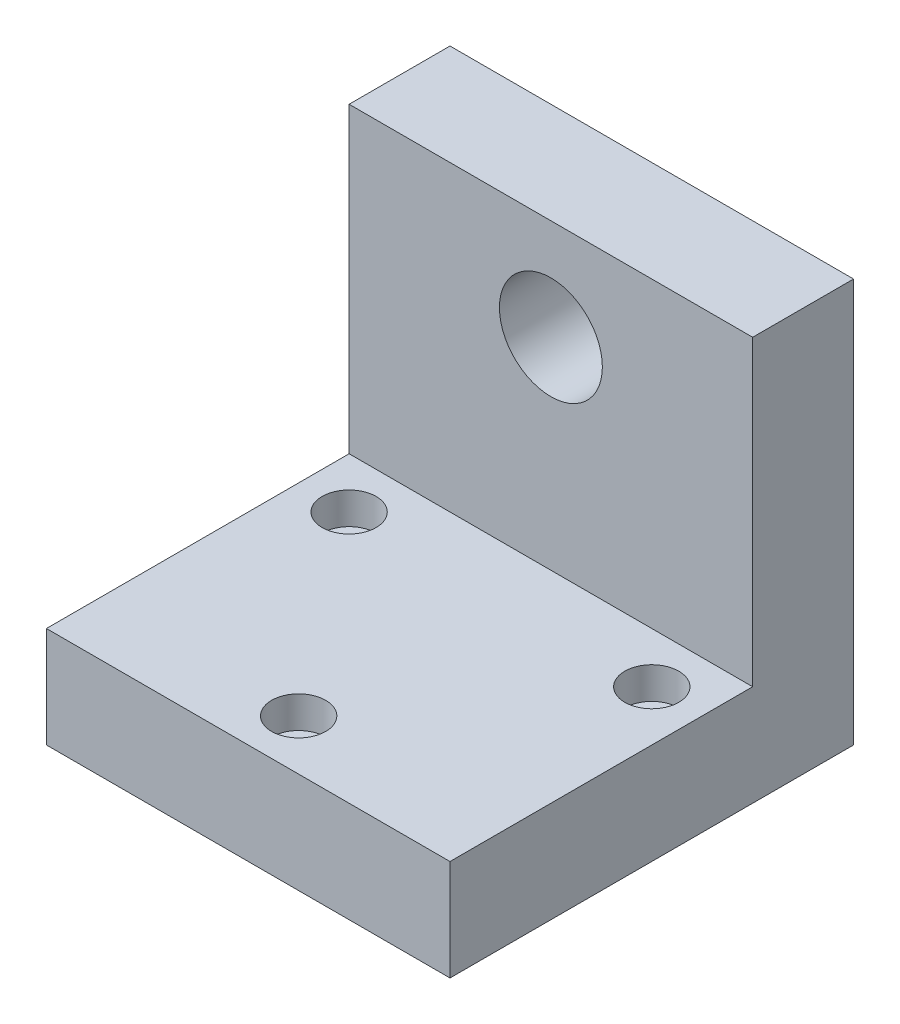
ISO-10303-21;
HEADER;
FILE_DESCRIPTION(('STEP AP214'),'2;1');
FILE_NAME('part.step','',(''),(''),'','','');
FILE_SCHEMA(('AUTOMOTIVE_DESIGN { 1 0 10303 214 1 1 1 1 }'));
ENDSEC;
DATA;
#1=APPLICATION_CONTEXT('core data for automotive mechanical design processes');
#2=APPLICATION_PROTOCOL_DEFINITION('international standard','automotive_design',2000,#1);
#3=PRODUCT_CONTEXT('',#1,'mechanical');
#4=PRODUCT('Part','Part','',(#3));
#5=PRODUCT_RELATED_PRODUCT_CATEGORY('part','',(#4));
#6=PRODUCT_DEFINITION_FORMATION('','',#4);
#7=PRODUCT_DEFINITION_CONTEXT('part definition',#1,'design');
#8=PRODUCT_DEFINITION('design','',#6,#7);
#9=PRODUCT_DEFINITION_SHAPE('','',#8);
#10=(LENGTH_UNIT() NAMED_UNIT(*) SI_UNIT(.MILLI.,.METRE.));
#11=(NAMED_UNIT(*) PLANE_ANGLE_UNIT() SI_UNIT($,.RADIAN.));
#12=(NAMED_UNIT(*) SI_UNIT($,.STERADIAN.) SOLID_ANGLE_UNIT());
#13=UNCERTAINTY_MEASURE_WITH_UNIT(LENGTH_MEASURE(1.E-05),#10,'distance_accuracy_value','');
#14=(GEOMETRIC_REPRESENTATION_CONTEXT(3) GLOBAL_UNCERTAINTY_ASSIGNED_CONTEXT((#13)) GLOBAL_UNIT_ASSIGNED_CONTEXT((#10,
#11,#12)) REPRESENTATION_CONTEXT('',''));
#15=CARTESIAN_POINT('',(0.,0.,0.));
#16=DIRECTION('',(0.,0.,1.));
#17=DIRECTION('',(1.,0.,0.));
#18=AXIS2_PLACEMENT_3D('',#15,#16,#17);
#19=CARTESIAN_POINT('',(12.7,0.,19.05));
#20=DIRECTION('',(0.,1.,0.));
#21=DIRECTION('',(-1.,0.,0.));
#22=AXIS2_PLACEMENT_3D('',#19,#20,#21);
#23=CYLINDRICAL_SURFACE('',#22,1.127000032);
#24=CARTESIAN_POINT('',(12.7,0.,19.05));
#25=DIRECTION('',(0.,1.,0.));
#26=DIRECTION('',(-1.,0.,0.));
#27=AXIS2_PLACEMENT_3D('',#24,#25,#26);
#28=CIRCLE('',#27,1.127000032);
#29=CARTESIAN_POINT('',(11.572999968,0.,19.05));
#30=VERTEX_POINT('',#29);
#31=EDGE_CURVE('E121',#30,#30,#28,.T.);
#32=ORIENTED_EDGE('',*,*,#31,.F.);
#33=EDGE_LOOP('',(#32));
#34=FACE_BOUND('',#33,.T.);
#35=CARTESIAN_POINT('',(12.7,4.349999936,19.05));
#36=DIRECTION('',(0.,1.,0.));
#37=DIRECTION('',(-1.,0.,0.));
#38=AXIS2_PLACEMENT_3D('',#35,#36,#37);
#39=CIRCLE('',#38,1.127000032);
#40=CARTESIAN_POINT('',(11.572999968,4.349999936,19.05));
#41=VERTEX_POINT('',#40);
#42=EDGE_CURVE('E41',#41,#41,#39,.F.);
#43=ORIENTED_EDGE('',*,*,#42,.F.);
#44=EDGE_LOOP('',(#43));
#45=FACE_BOUND('',#44,.T.);
#46=ADVANCED_FACE('F37',(#34,#45),#23,.F.);
#47=CARTESIAN_POINT('',(22.225,0.,6.35));
#48=DIRECTION('',(0.,1.,0.));
#49=DIRECTION('',(-1.,0.,0.));
#50=AXIS2_PLACEMENT_3D('',#47,#48,#49);
#51=CYLINDRICAL_SURFACE('',#50,1.127000032);
#52=CARTESIAN_POINT('',(22.225,0.,6.35));
#53=DIRECTION('',(0.,1.,0.));
#54=DIRECTION('',(-1.,0.,0.));
#55=AXIS2_PLACEMENT_3D('',#52,#53,#54);
#56=CIRCLE('',#55,1.127000032);
#57=CARTESIAN_POINT('',(21.097999968,0.,6.35));
#58=VERTEX_POINT('',#57);
#59=EDGE_CURVE('E125',#58,#58,#56,.T.);
#60=ORIENTED_EDGE('',*,*,#59,.F.);
#61=EDGE_LOOP('',(#60));
#62=FACE_BOUND('',#61,.T.);
#63=CARTESIAN_POINT('',(22.225,4.349999936,6.35));
#64=DIRECTION('',(0.,1.,0.));
#65=DIRECTION('',(-1.,0.,0.));
#66=AXIS2_PLACEMENT_3D('',#63,#64,#65);
#67=CIRCLE('',#66,1.127000032);
#68=CARTESIAN_POINT('',(21.097999968,4.349999936,6.35));
#69=VERTEX_POINT('',#68);
#70=EDGE_CURVE('E115',#69,#69,#67,.F.);
#71=ORIENTED_EDGE('',*,*,#70,.F.);
#72=EDGE_LOOP('',(#71));
#73=FACE_BOUND('',#72,.T.);
#74=ADVANCED_FACE('F188',(#62,#73),#51,.F.);
#75=CARTESIAN_POINT('',(3.17499999999999,0.,6.35));
#76=DIRECTION('',(0.,1.,0.));
#77=DIRECTION('',(-1.,0.,0.));
#78=AXIS2_PLACEMENT_3D('',#75,#76,#77);
#79=CYLINDRICAL_SURFACE('',#78,1.127000032);
#80=CARTESIAN_POINT('',(3.17499999999999,0.,6.35));
#81=DIRECTION('',(0.,1.,0.));
#82=DIRECTION('',(-1.,0.,0.));
#83=AXIS2_PLACEMENT_3D('',#80,#81,#82);
#84=CIRCLE('',#83,1.127000032);
#85=CARTESIAN_POINT('',(2.047999968,0.,6.35));
#86=VERTEX_POINT('',#85);
#87=EDGE_CURVE('E130',#86,#86,#84,.T.);
#88=ORIENTED_EDGE('',*,*,#87,.F.);
#89=EDGE_LOOP('',(#88));
#90=FACE_BOUND('',#89,.T.);
#91=CARTESIAN_POINT('',(3.17499999999999,4.349999936,6.35));
#92=DIRECTION('',(0.,1.,0.));
#93=DIRECTION('',(-1.,0.,0.));
#94=AXIS2_PLACEMENT_3D('',#91,#92,#93);
#95=CIRCLE('',#94,1.127000032);
#96=CARTESIAN_POINT('',(2.047999968,4.349999936,6.35));
#97=VERTEX_POINT('',#96);
#98=EDGE_CURVE('E113',#97,#97,#95,.F.);
#99=ORIENTED_EDGE('',*,*,#98,.F.);
#100=EDGE_LOOP('',(#99));
#101=FACE_BOUND('',#100,.T.);
#102=ADVANCED_FACE('F194',(#90,#101),#79,.F.);
#103=CARTESIAN_POINT('',(0.,0.,3.175));
#104=DIRECTION('',(0.,0.,-1.));
#105=DIRECTION('',(-1.,0.,0.));
#106=AXIS2_PLACEMENT_3D('',#103,#104,#105);
#107=PLANE('',#106);
#108=CARTESIAN_POINT('',(12.7,19.05,3.175));
#109=DIRECTION('',(0.,0.,-1.));
#110=DIRECTION('',(-1.,0.,0.));
#111=AXIS2_PLACEMENT_3D('',#108,#109,#110);
#112=CIRCLE('',#111,3.2385);
#113=CARTESIAN_POINT('',(9.46149999999999,19.05,3.175));
#114=VERTEX_POINT('',#113);
#115=EDGE_CURVE('E236',#114,#114,#112,.T.);
#116=ORIENTED_EDGE('',*,*,#115,.T.);
#117=EDGE_LOOP('',(#116));
#118=FACE_BOUND('',#117,.T.);
#119=DIRECTION('',(-1.,0.,0.));
#120=VECTOR('',#119,1.);
#121=CARTESIAN_POINT('',(0.,6.35,3.175));
#122=LINE('',#121,#120);
#123=CARTESIAN_POINT('',(25.4,6.35,3.175));
#124=VERTEX_POINT('',#123);
#125=CARTESIAN_POINT('',(0.,6.35,3.175));
#126=VERTEX_POINT('',#125);
#127=EDGE_CURVE('E54',#124,#126,#122,.T.);
#128=ORIENTED_EDGE('',*,*,#127,.F.);
#129=DIRECTION('',(0.,1.,0.));
#130=VECTOR('',#129,1.);
#131=CARTESIAN_POINT('',(25.4,0.,3.175));
#132=LINE('',#131,#130);
#133=CARTESIAN_POINT('',(25.4,25.4,3.175));
#134=VERTEX_POINT('',#133);
#135=EDGE_CURVE('E148',#124,#134,#132,.T.);
#136=ORIENTED_EDGE('',*,*,#135,.T.);
#137=DIRECTION('',(-1.,0.,0.));
#138=VECTOR('',#137,1.);
#139=CARTESIAN_POINT('',(0.,25.4,3.175));
#140=LINE('',#139,#138);
#141=CARTESIAN_POINT('',(0.,25.4,3.175));
#142=VERTEX_POINT('',#141);
#143=EDGE_CURVE('E60',#134,#142,#140,.T.);
#144=ORIENTED_EDGE('',*,*,#143,.T.);
#145=DIRECTION('',(0.,-1.,0.));
#146=VECTOR('',#145,1.);
#147=CARTESIAN_POINT('',(0.,0.,3.175));
#148=LINE('',#147,#146);
#149=EDGE_CURVE('E89',#142,#126,#148,.T.);
#150=ORIENTED_EDGE('',*,*,#149,.T.);
#151=EDGE_LOOP('',(#128,#136,#144,#150));
#152=FACE_BOUND('',#151,.T.);
#153=ADVANCED_FACE('F149',(#118,#152),#107,.F.);
#154=CARTESIAN_POINT('',(0.,0.,3.175));
#155=DIRECTION('',(1.,0.,0.));
#156=DIRECTION('',(0.,1.,0.));
#157=AXIS2_PLACEMENT_3D('',#154,#155,#156);
#158=PLANE('',#157);
#159=DIRECTION('',(0.,-1.,0.));
#160=VECTOR('',#159,1.);
#161=CARTESIAN_POINT('',(0.,0.,-3.175));
#162=LINE('',#161,#160);
#163=CARTESIAN_POINT('',(0.,25.4,-3.175));
#164=VERTEX_POINT('',#163);
#165=CARTESIAN_POINT('',(0.,0.,-3.175));
#166=VERTEX_POINT('',#165);
#167=EDGE_CURVE('E95',#164,#166,#162,.T.);
#168=ORIENTED_EDGE('',*,*,#167,.T.);
#169=DIRECTION('',(0.,0.,-1.));
#170=VECTOR('',#169,1.);
#171=CARTESIAN_POINT('',(0.,0.,3.175));
#172=LINE('',#171,#170);
#173=CARTESIAN_POINT('',(0.,0.,22.225));
#174=VERTEX_POINT('',#173);
#175=EDGE_CURVE('E11',#174,#166,#172,.T.);
#176=ORIENTED_EDGE('',*,*,#175,.F.);
#177=DIRECTION('',(0.,-1.,0.));
#178=VECTOR('',#177,1.);
#179=CARTESIAN_POINT('',(0.,6.35,22.225));
#180=LINE('',#179,#178);
#181=CARTESIAN_POINT('',(0.,6.35,22.225));
#182=VERTEX_POINT('',#181);
#183=EDGE_CURVE('E134',#182,#174,#180,.T.);
#184=ORIENTED_EDGE('',*,*,#183,.F.);
#185=DIRECTION('',(0.,0.,-1.));
#186=VECTOR('',#185,1.);
#187=CARTESIAN_POINT('',(0.,6.35,22.225));
#188=LINE('',#187,#186);
#189=EDGE_CURVE('E104',#182,#126,#188,.T.);
#190=ORIENTED_EDGE('',*,*,#189,.T.);
#191=ORIENTED_EDGE('',*,*,#149,.F.);
#192=DIRECTION('',(0.,0.,-1.));
#193=VECTOR('',#192,1.);
#194=CARTESIAN_POINT('',(0.,25.4,3.175));
#195=LINE('',#194,#193);
#196=EDGE_CURVE('E82',#142,#164,#195,.T.);
#197=ORIENTED_EDGE('',*,*,#196,.T.);
#198=EDGE_LOOP('',(#168,#176,#184,#190,#191,#197));
#199=FACE_BOUND('',#198,.T.);
#200=ADVANCED_FACE('F39',(#199),#158,.F.);
#201=CARTESIAN_POINT('',(0.,0.,3.175));
#202=DIRECTION('',(0.,1.,0.));
#203=DIRECTION('',(0.,0.,1.));
#204=AXIS2_PLACEMENT_3D('',#201,#202,#203);
#205=PLANE('',#204);
#206=ORIENTED_EDGE('',*,*,#87,.T.);
#207=EDGE_LOOP('',(#206));
#208=FACE_BOUND('',#207,.T.);
#209=ORIENTED_EDGE('',*,*,#59,.T.);
#210=EDGE_LOOP('',(#209));
#211=FACE_BOUND('',#210,.T.);
#212=ORIENTED_EDGE('',*,*,#31,.T.);
#213=EDGE_LOOP('',(#212));
#214=FACE_BOUND('',#213,.T.);
#215=DIRECTION('',(1.,0.,0.));
#216=VECTOR('',#215,1.);
#217=CARTESIAN_POINT('',(0.,0.,-3.175));
#218=LINE('',#217,#216);
#219=CARTESIAN_POINT('',(25.4,0.,-3.175));
#220=VERTEX_POINT('',#219);
#221=EDGE_CURVE('E99',#166,#220,#218,.T.);
#222=ORIENTED_EDGE('',*,*,#221,.T.);
#223=DIRECTION('',(0.,0.,-1.));
#224=VECTOR('',#223,1.);
#225=CARTESIAN_POINT('',(25.4,0.,3.175));
#226=LINE('',#225,#224);
#227=CARTESIAN_POINT('',(25.4,0.,22.225));
#228=VERTEX_POINT('',#227);
#229=EDGE_CURVE('E46',#228,#220,#226,.T.);
#230=ORIENTED_EDGE('',*,*,#229,.F.);
#231=DIRECTION('',(1.,0.,0.));
#232=VECTOR('',#231,1.);
#233=CARTESIAN_POINT('',(0.,0.,22.225));
#234=LINE('',#233,#232);
#235=EDGE_CURVE('E137',#174,#228,#234,.T.);
#236=ORIENTED_EDGE('',*,*,#235,.F.);
#237=ORIENTED_EDGE('',*,*,#175,.T.);
#238=EDGE_LOOP('',(#222,#230,#236,#237));
#239=FACE_BOUND('',#238,.T.);
#240=ADVANCED_FACE('F158',(#208,#211,#214,#239),#205,.F.);
#241=CARTESIAN_POINT('',(25.4,0.,3.175));
#242=DIRECTION('',(-1.,0.,0.));
#243=DIRECTION('',(0.,-1.,0.));
#244=AXIS2_PLACEMENT_3D('',#241,#242,#243);
#245=PLANE('',#244);
#246=DIRECTION('',(0.,1.,0.));
#247=VECTOR('',#246,1.);
#248=CARTESIAN_POINT('',(25.4,0.,-3.175));
#249=LINE('',#248,#247);
#250=CARTESIAN_POINT('',(25.4,25.4,-3.175));
#251=VERTEX_POINT('',#250);
#252=EDGE_CURVE('E90',#220,#251,#249,.T.);
#253=ORIENTED_EDGE('',*,*,#252,.T.);
#254=DIRECTION('',(0.,0.,-1.));
#255=VECTOR('',#254,1.);
#256=CARTESIAN_POINT('',(25.4,25.4,3.175));
#257=LINE('',#256,#255);
#258=EDGE_CURVE('E85',#134,#251,#257,.T.);
#259=ORIENTED_EDGE('',*,*,#258,.F.);
#260=ORIENTED_EDGE('',*,*,#135,.F.);
#261=DIRECTION('',(0.,0.,-1.));
#262=VECTOR('',#261,1.);
#263=CARTESIAN_POINT('',(25.4,6.35,22.225));
#264=LINE('',#263,#262);
#265=CARTESIAN_POINT('',(25.4,6.35,22.225));
#266=VERTEX_POINT('',#265);
#267=EDGE_CURVE('E100',#266,#124,#264,.T.);
#268=ORIENTED_EDGE('',*,*,#267,.F.);
#269=DIRECTION('',(0.,1.,0.));
#270=VECTOR('',#269,1.);
#271=CARTESIAN_POINT('',(25.4,6.35,22.225));
#272=LINE('',#271,#270);
#273=EDGE_CURVE('E140',#228,#266,#272,.T.);
#274=ORIENTED_EDGE('',*,*,#273,.F.);
#275=ORIENTED_EDGE('',*,*,#229,.T.);
#276=EDGE_LOOP('',(#253,#259,#260,#268,#274,#275));
#277=FACE_BOUND('',#276,.T.);
#278=ADVANCED_FACE('F152',(#277),#245,.F.);
#279=CARTESIAN_POINT('',(0.,25.4,3.175));
#280=DIRECTION('',(0.,-1.,0.));
#281=DIRECTION('',(0.,0.,-1.));
#282=AXIS2_PLACEMENT_3D('',#279,#280,#281);
#283=PLANE('',#282);
#284=DIRECTION('',(-1.,0.,0.));
#285=VECTOR('',#284,1.);
#286=CARTESIAN_POINT('',(0.,25.4,-3.175));
#287=LINE('',#286,#285);
#288=EDGE_CURVE('E79',#251,#164,#287,.T.);
#289=ORIENTED_EDGE('',*,*,#288,.T.);
#290=ORIENTED_EDGE('',*,*,#196,.F.);
#291=ORIENTED_EDGE('',*,*,#143,.F.);
#292=ORIENTED_EDGE('',*,*,#258,.T.);
#293=EDGE_LOOP('',(#289,#290,#291,#292));
#294=FACE_BOUND('',#293,.T.);
#295=ADVANCED_FACE('F81',(#294),#283,.F.);
#296=CARTESIAN_POINT('',(0.,0.,-3.175));
#297=DIRECTION('',(0.,0.,-1.));
#298=DIRECTION('',(-1.,0.,0.));
#299=AXIS2_PLACEMENT_3D('',#296,#297,#298);
#300=PLANE('',#299);
#301=CARTESIAN_POINT('',(12.7,19.05,-3.175));
#302=DIRECTION('',(0.,0.,1.));
#303=DIRECTION('',(1.,0.,0.));
#304=AXIS2_PLACEMENT_3D('',#301,#302,#303);
#305=CIRCLE('',#304,3.2385);
#306=CARTESIAN_POINT('',(15.9385,19.05,-3.175));
#307=VERTEX_POINT('',#306);
#308=EDGE_CURVE('E233',#307,#307,#305,.T.);
#309=ORIENTED_EDGE('',*,*,#308,.T.);
#310=EDGE_LOOP('',(#309));
#311=FACE_BOUND('',#310,.T.);
#312=ORIENTED_EDGE('',*,*,#167,.F.);
#313=ORIENTED_EDGE('',*,*,#288,.F.);
#314=ORIENTED_EDGE('',*,*,#252,.F.);
#315=ORIENTED_EDGE('',*,*,#221,.F.);
#316=EDGE_LOOP('',(#312,#313,#314,#315));
#317=FACE_BOUND('',#316,.T.);
#318=ADVANCED_FACE('F98',(#311,#317),#300,.T.);
#319=CARTESIAN_POINT('',(0.,6.35,22.225));
#320=DIRECTION('',(0.,-1.,0.));
#321=DIRECTION('',(1.,0.,0.));
#322=AXIS2_PLACEMENT_3D('',#319,#320,#321);
#323=PLANE('',#322);
#324=CARTESIAN_POINT('',(3.17499999999999,6.35,6.35));
#325=DIRECTION('',(0.,1.,0.));
#326=DIRECTION('',(-1.,0.,0.));
#327=AXIS2_PLACEMENT_3D('',#324,#325,#326);
#328=CIRCLE('',#327,1.700000029);
#329=CARTESIAN_POINT('',(1.47499997099999,6.35,6.35));
#330=VERTEX_POINT('',#329);
#331=EDGE_CURVE('E247',#330,#330,#328,.T.);
#332=ORIENTED_EDGE('',*,*,#331,.F.);
#333=EDGE_LOOP('',(#332));
#334=FACE_BOUND('',#333,.T.);
#335=CARTESIAN_POINT('',(22.225,6.35,6.35));
#336=DIRECTION('',(0.,1.,0.));
#337=DIRECTION('',(-1.,0.,0.));
#338=AXIS2_PLACEMENT_3D('',#335,#336,#337);
#339=CIRCLE('',#338,1.700000029);
#340=CARTESIAN_POINT('',(20.524999971,6.35,6.35));
#341=VERTEX_POINT('',#340);
#342=EDGE_CURVE('E250',#341,#341,#339,.T.);
#343=ORIENTED_EDGE('',*,*,#342,.F.);
#344=EDGE_LOOP('',(#343));
#345=FACE_BOUND('',#344,.T.);
#346=CARTESIAN_POINT('',(12.7,6.35,19.05));
#347=DIRECTION('',(0.,1.,0.));
#348=DIRECTION('',(-1.,0.,0.));
#349=AXIS2_PLACEMENT_3D('',#346,#347,#348);
#350=CIRCLE('',#349,1.700000029);
#351=CARTESIAN_POINT('',(10.999999971,6.35,19.05));
#352=VERTEX_POINT('',#351);
#353=EDGE_CURVE('E241',#352,#352,#350,.T.);
#354=ORIENTED_EDGE('',*,*,#353,.F.);
#355=EDGE_LOOP('',(#354));
#356=FACE_BOUND('',#355,.T.);
#357=ORIENTED_EDGE('',*,*,#127,.T.);
#358=ORIENTED_EDGE('',*,*,#189,.F.);
#359=DIRECTION('',(-1.,0.,0.));
#360=VECTOR('',#359,1.);
#361=CARTESIAN_POINT('',(0.,6.35,22.225));
#362=LINE('',#361,#360);
#363=EDGE_CURVE('E143',#266,#182,#362,.T.);
#364=ORIENTED_EDGE('',*,*,#363,.F.);
#365=ORIENTED_EDGE('',*,*,#267,.T.);
#366=EDGE_LOOP('',(#357,#358,#364,#365));
#367=FACE_BOUND('',#366,.T.);
#368=ADVANCED_FACE('F172',(#334,#345,#356,#367),#323,.F.);
#369=CARTESIAN_POINT('',(0.,0.,22.225));
#370=DIRECTION('',(0.,0.,1.));
#371=DIRECTION('',(1.,0.,0.));
#372=AXIS2_PLACEMENT_3D('',#369,#370,#371);
#373=PLANE('',#372);
#374=ORIENTED_EDGE('',*,*,#183,.T.);
#375=ORIENTED_EDGE('',*,*,#235,.T.);
#376=ORIENTED_EDGE('',*,*,#273,.T.);
#377=ORIENTED_EDGE('',*,*,#363,.T.);
#378=EDGE_LOOP('',(#374,#375,#376,#377));
#379=FACE_BOUND('',#378,.T.);
#380=ADVANCED_FACE('F163',(#379),#373,.T.);
#381=CARTESIAN_POINT('',(3.17499999999999,4.349999936,6.35));
#382=DIRECTION('',(0.,1.,0.));
#383=DIRECTION('',(-1.,0.,0.));
#384=AXIS2_PLACEMENT_3D('',#381,#382,#383);
#385=PLANE('',#384);
#386=CARTESIAN_POINT('',(3.17499999999999,4.349999936,6.35));
#387=DIRECTION('',(0.,1.,0.));
#388=DIRECTION('',(-1.,0.,0.));
#389=AXIS2_PLACEMENT_3D('',#386,#387,#388);
#390=CIRCLE('',#389,1.700000029);
#391=CARTESIAN_POINT('',(1.47499997099999,4.349999936,6.35));
#392=VERTEX_POINT('',#391);
#393=EDGE_CURVE('E116',#392,#392,#390,.T.);
#394=ORIENTED_EDGE('',*,*,#393,.T.);
#395=EDGE_LOOP('',(#394));
#396=FACE_BOUND('',#395,.T.);
#397=ORIENTED_EDGE('',*,*,#98,.T.);
#398=EDGE_LOOP('',(#397));
#399=FACE_BOUND('',#398,.T.);
#400=ADVANCED_FACE('F180',(#396,#399),#385,.T.);
#401=CARTESIAN_POINT('',(3.17499999999999,4.349999936,6.35));
#402=DIRECTION('',(0.,1.,0.));
#403=DIRECTION('',(-1.,0.,0.));
#404=AXIS2_PLACEMENT_3D('',#401,#402,#403);
#405=CYLINDRICAL_SURFACE('',#404,1.700000029);
#406=ORIENTED_EDGE('',*,*,#393,.F.);
#407=EDGE_LOOP('',(#406));
#408=FACE_BOUND('',#407,.T.);
#409=ORIENTED_EDGE('',*,*,#331,.T.);
#410=EDGE_LOOP('',(#409));
#411=FACE_BOUND('',#410,.T.);
#412=ADVANCED_FACE('F215',(#408,#411),#405,.F.);
#413=CARTESIAN_POINT('',(22.225,4.349999936,6.35));
#414=DIRECTION('',(0.,1.,0.));
#415=DIRECTION('',(-1.,0.,0.));
#416=AXIS2_PLACEMENT_3D('',#413,#414,#415);
#417=PLANE('',#416);
#418=CARTESIAN_POINT('',(22.225,4.349999936,6.35));
#419=DIRECTION('',(0.,1.,0.));
#420=DIRECTION('',(-1.,0.,0.));
#421=AXIS2_PLACEMENT_3D('',#418,#419,#420);
#422=CIRCLE('',#421,1.700000029);
#423=CARTESIAN_POINT('',(20.524999971,4.349999936,6.35));
#424=VERTEX_POINT('',#423);
#425=EDGE_CURVE('E253',#424,#424,#422,.T.);
#426=ORIENTED_EDGE('',*,*,#425,.T.);
#427=EDGE_LOOP('',(#426));
#428=FACE_BOUND('',#427,.T.);
#429=ORIENTED_EDGE('',*,*,#70,.T.);
#430=EDGE_LOOP('',(#429));
#431=FACE_BOUND('',#430,.T.);
#432=ADVANCED_FACE('F212',(#428,#431),#417,.T.);
#433=CARTESIAN_POINT('',(22.225,4.349999936,6.35));
#434=DIRECTION('',(0.,1.,0.));
#435=DIRECTION('',(-1.,0.,0.));
#436=AXIS2_PLACEMENT_3D('',#433,#434,#435);
#437=CYLINDRICAL_SURFACE('',#436,1.700000029);
#438=ORIENTED_EDGE('',*,*,#425,.F.);
#439=EDGE_LOOP('',(#438));
#440=FACE_BOUND('',#439,.T.);
#441=ORIENTED_EDGE('',*,*,#342,.T.);
#442=EDGE_LOOP('',(#441));
#443=FACE_BOUND('',#442,.T.);
#444=ADVANCED_FACE('F206',(#440,#443),#437,.F.);
#445=CARTESIAN_POINT('',(12.7,4.349999936,19.05));
#446=DIRECTION('',(0.,1.,0.));
#447=DIRECTION('',(-1.,0.,0.));
#448=AXIS2_PLACEMENT_3D('',#445,#446,#447);
#449=PLANE('',#448);
#450=CARTESIAN_POINT('',(12.7,4.349999936,19.05));
#451=DIRECTION('',(0.,1.,0.));
#452=DIRECTION('',(-1.,0.,0.));
#453=AXIS2_PLACEMENT_3D('',#450,#451,#452);
#454=CIRCLE('',#453,1.700000029);
#455=CARTESIAN_POINT('',(10.999999971,4.349999936,19.05));
#456=VERTEX_POINT('',#455);
#457=EDGE_CURVE('E238',#456,#456,#454,.T.);
#458=ORIENTED_EDGE('',*,*,#457,.T.);
#459=EDGE_LOOP('',(#458));
#460=FACE_BOUND('',#459,.T.);
#461=ORIENTED_EDGE('',*,*,#42,.T.);
#462=EDGE_LOOP('',(#461));
#463=FACE_BOUND('',#462,.T.);
#464=ADVANCED_FACE('F202',(#460,#463),#449,.T.);
#465=CARTESIAN_POINT('',(12.7,4.349999936,19.05));
#466=DIRECTION('',(0.,1.,0.));
#467=DIRECTION('',(-1.,0.,0.));
#468=AXIS2_PLACEMENT_3D('',#465,#466,#467);
#469=CYLINDRICAL_SURFACE('',#468,1.700000029);
#470=ORIENTED_EDGE('',*,*,#457,.F.);
#471=EDGE_LOOP('',(#470));
#472=FACE_BOUND('',#471,.T.);
#473=ORIENTED_EDGE('',*,*,#353,.T.);
#474=EDGE_LOOP('',(#473));
#475=FACE_BOUND('',#474,.T.);
#476=ADVANCED_FACE('F205',(#472,#475),#469,.F.);
#477=CARTESIAN_POINT('',(12.7,19.05,-3.175));
#478=DIRECTION('',(0.,0.,1.));
#479=DIRECTION('',(1.,0.,0.));
#480=AXIS2_PLACEMENT_3D('',#477,#478,#479);
#481=CYLINDRICAL_SURFACE('',#480,3.2385);
#482=ORIENTED_EDGE('',*,*,#308,.F.);
#483=EDGE_LOOP('',(#482));
#484=FACE_BOUND('',#483,.T.);
#485=ORIENTED_EDGE('',*,*,#115,.F.);
#486=EDGE_LOOP('',(#485));
#487=FACE_BOUND('',#486,.T.);
#488=ADVANCED_FACE('F210',(#484,#487),#481,.F.);
#489=CLOSED_SHELL('',(#46,#74,#102,#153,#200,#240,#278,#295,#318,#368,#380,#400,#412,#432,#444,
#464,#476,#488));
#490=MANIFOLD_SOLID_BREP('B2',#489);
#491=ADVANCED_BREP_SHAPE_REPRESENTATION('',(#18,#490),#14);
#492=SHAPE_DEFINITION_REPRESENTATION(#9,#491);
ENDSEC;
END-ISO-10303-21;
